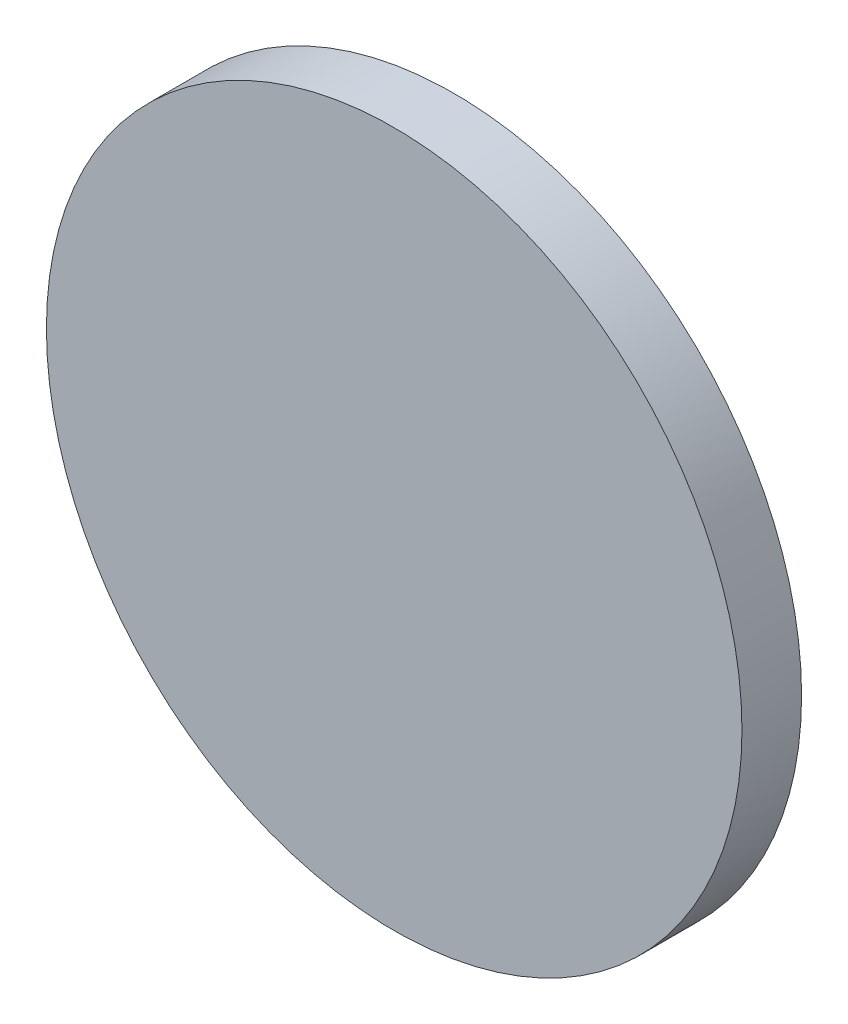
ISO-10303-21;
HEADER;
FILE_DESCRIPTION(('STEP AP214'),'2;1');
FILE_NAME('part.step','',(''),(''),'','','');
FILE_SCHEMA(('AUTOMOTIVE_DESIGN { 1 0 10303 214 1 1 1 1 }'));
ENDSEC;
DATA;
#1=APPLICATION_CONTEXT('core data for automotive mechanical design processes');
#2=APPLICATION_PROTOCOL_DEFINITION('international standard','automotive_design',2000,#1);
#3=PRODUCT_CONTEXT('',#1,'mechanical');
#4=PRODUCT('Part','Part','',(#3));
#5=PRODUCT_RELATED_PRODUCT_CATEGORY('part','',(#4));
#6=PRODUCT_DEFINITION_FORMATION('','',#4);
#7=PRODUCT_DEFINITION_CONTEXT('part definition',#1,'design');
#8=PRODUCT_DEFINITION('design','',#6,#7);
#9=PRODUCT_DEFINITION_SHAPE('','',#8);
#10=(LENGTH_UNIT() NAMED_UNIT(*) SI_UNIT(.MILLI.,.METRE.));
#11=(NAMED_UNIT(*) PLANE_ANGLE_UNIT() SI_UNIT($,.RADIAN.));
#12=(NAMED_UNIT(*) SI_UNIT($,.STERADIAN.) SOLID_ANGLE_UNIT());
#13=UNCERTAINTY_MEASURE_WITH_UNIT(LENGTH_MEASURE(1.E-05),#10,'distance_accuracy_value','');
#14=(GEOMETRIC_REPRESENTATION_CONTEXT(3) GLOBAL_UNCERTAINTY_ASSIGNED_CONTEXT((#13)) GLOBAL_UNIT_ASSIGNED_CONTEXT((#10,
#11,#12)) REPRESENTATION_CONTEXT('',''));
#15=CARTESIAN_POINT('',(0.,0.,0.));
#16=DIRECTION('',(0.,0.,1.));
#17=DIRECTION('',(1.,0.,0.));
#18=AXIS2_PLACEMENT_3D('',#15,#16,#17);
#19=CARTESIAN_POINT('',(3.80008,10.900000006176,0.76487));
#20=DIRECTION('',(0.,0.,-1.));
#21=DIRECTION('',(-1.,0.,0.));
#22=AXIS2_PLACEMENT_3D('',#19,#20,#21);
#23=PLANE('',#22);
#24=CARTESIAN_POINT('',(3.80008,10.900000006176,0.76487));
#25=DIRECTION('',(0.,0.,1.));
#26=DIRECTION('',(1.,0.,0.));
#27=AXIS2_PLACEMENT_3D('',#24,#25,#26);
#28=CIRCLE('',#27,0.200024667);
#29=CARTESIAN_POINT('',(4.000104667,10.900000006176,0.76487));
#30=VERTEX_POINT('',#29);
#31=EDGE_CURVE('E18',#30,#30,#28,.T.);
#32=ORIENTED_EDGE('',*,*,#31,.F.);
#33=EDGE_LOOP('',(#32));
#34=FACE_BOUND('',#33,.T.);
#35=ADVANCED_FACE('F15',(#34),#23,.T.);
#36=CARTESIAN_POINT('',(3.80008,10.900000006176,0.76487));
#37=DIRECTION('',(0.,0.,1.));
#38=DIRECTION('',(1.,0.,0.));
#39=AXIS2_PLACEMENT_3D('',#36,#37,#38);
#40=CYLINDRICAL_SURFACE('',#39,0.200024667);
#41=CARTESIAN_POINT('',(3.80008,10.900000006176,0.79916));
#42=DIRECTION('',(0.,0.,1.));
#43=DIRECTION('',(1.,0.,0.));
#44=AXIS2_PLACEMENT_3D('',#41,#42,#43);
#45=CIRCLE('',#44,0.200024667);
#46=CARTESIAN_POINT('',(4.000104667,10.900000006176,0.79916));
#47=VERTEX_POINT('',#46);
#48=EDGE_CURVE('E10',#47,#47,#45,.T.);
#49=ORIENTED_EDGE('',*,*,#48,.F.);
#50=EDGE_LOOP('',(#49));
#51=FACE_BOUND('',#50,.T.);
#52=ORIENTED_EDGE('',*,*,#31,.T.);
#53=EDGE_LOOP('',(#52));
#54=FACE_BOUND('',#53,.T.);
#55=ADVANCED_FACE('F27',(#51,#54),#40,.T.);
#56=CARTESIAN_POINT('',(3.80008,10.900000006176,0.79916));
#57=DIRECTION('',(0.,0.,1.));
#58=DIRECTION('',(1.,0.,0.));
#59=AXIS2_PLACEMENT_3D('',#56,#57,#58);
#60=PLANE('',#59);
#61=ORIENTED_EDGE('',*,*,#48,.T.);
#62=EDGE_LOOP('',(#61));
#63=FACE_BOUND('',#62,.T.);
#64=ADVANCED_FACE('F34',(#63),#60,.T.);
#65=CLOSED_SHELL('',(#35,#55,#64));
#66=MANIFOLD_SOLID_BREP('B1',#65);
#67=ADVANCED_BREP_SHAPE_REPRESENTATION('',(#18,#66),#14);
#68=SHAPE_DEFINITION_REPRESENTATION(#9,#67);
ENDSEC;
END-ISO-10303-21;
